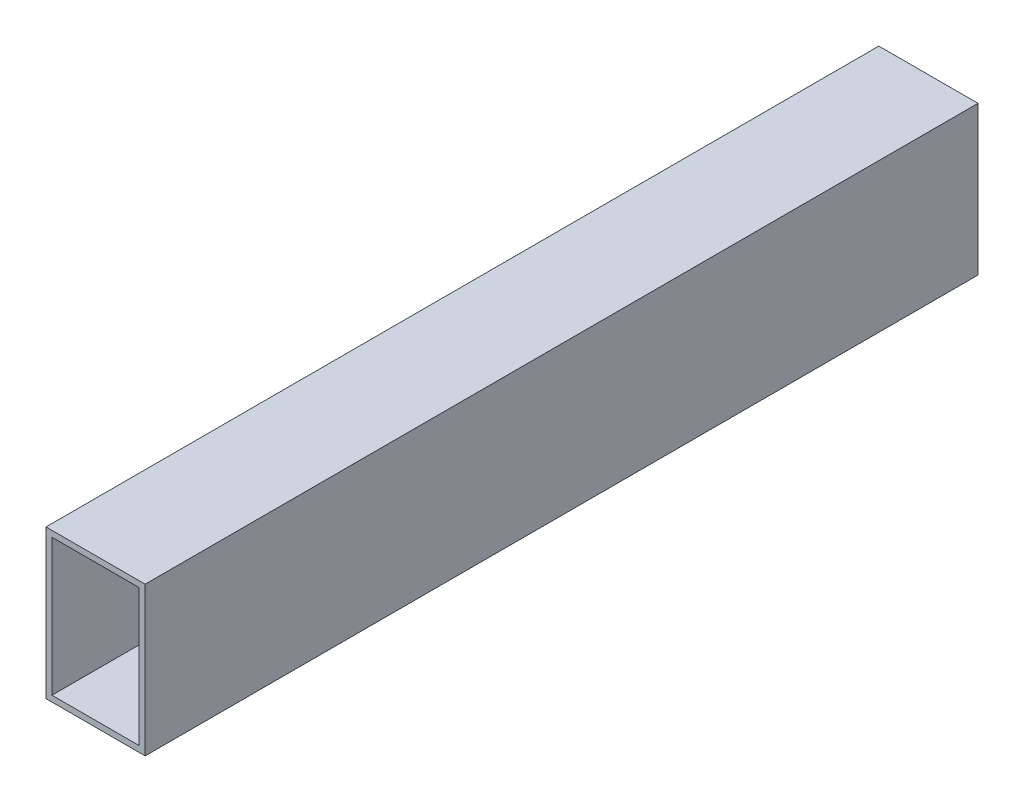
ISO-10303-21;
HEADER;
FILE_DESCRIPTION(('STEP AP214'),'2;1');
FILE_NAME('part.step','',(''),(''),'','','');
FILE_SCHEMA(('AUTOMOTIVE_DESIGN { 1 0 10303 214 1 1 1 1 }'));
ENDSEC;
DATA;
#1=APPLICATION_CONTEXT('core data for automotive mechanical design processes');
#2=APPLICATION_PROTOCOL_DEFINITION('international standard','automotive_design',2000,#1);
#3=PRODUCT_CONTEXT('',#1,'mechanical');
#4=PRODUCT('Part','Part','',(#3));
#5=PRODUCT_RELATED_PRODUCT_CATEGORY('part','',(#4));
#6=PRODUCT_DEFINITION_FORMATION('','',#4);
#7=PRODUCT_DEFINITION_CONTEXT('part definition',#1,'design');
#8=PRODUCT_DEFINITION('design','',#6,#7);
#9=PRODUCT_DEFINITION_SHAPE('','',#8);
#10=(LENGTH_UNIT() NAMED_UNIT(*) SI_UNIT(.MILLI.,.METRE.));
#11=(NAMED_UNIT(*) PLANE_ANGLE_UNIT() SI_UNIT($,.RADIAN.));
#12=(NAMED_UNIT(*) SI_UNIT($,.STERADIAN.) SOLID_ANGLE_UNIT());
#13=UNCERTAINTY_MEASURE_WITH_UNIT(LENGTH_MEASURE(1.E-05),#10,'distance_accuracy_value','');
#14=(GEOMETRIC_REPRESENTATION_CONTEXT(3) GLOBAL_UNCERTAINTY_ASSIGNED_CONTEXT((#13)) GLOBAL_UNIT_ASSIGNED_CONTEXT((#10,
#11,#12)) REPRESENTATION_CONTEXT('',''));
#15=CARTESIAN_POINT('',(0.,0.,0.));
#16=DIRECTION('',(0.,0.,1.));
#17=DIRECTION('',(1.,0.,0.));
#18=AXIS2_PLACEMENT_3D('',#15,#16,#17);
#19=CARTESIAN_POINT('',(0.,0.,420.));
#20=DIRECTION('',(0.,0.,-1.));
#21=DIRECTION('',(-1.,0.,0.));
#22=AXIS2_PLACEMENT_3D('',#19,#20,#21);
#23=PLANE('',#22);
#24=DIRECTION('',(0.,-1.,0.));
#25=VECTOR('',#24,1.);
#26=CARTESIAN_POINT('',(-50.,-75.,420.));
#27=LINE('',#26,#25);
#28=CARTESIAN_POINT('',(-50.,74.9999999999999,420.));
#29=VERTEX_POINT('',#28);
#30=CARTESIAN_POINT('',(-50.,-75.,420.));
#31=VERTEX_POINT('',#30);
#32=EDGE_CURVE('E139',#29,#31,#27,.T.);
#33=ORIENTED_EDGE('',*,*,#32,.T.);
#34=DIRECTION('',(1.,0.,0.));
#35=VECTOR('',#34,1.);
#36=CARTESIAN_POINT('',(-50.,-75.,420.));
#37=LINE('',#36,#35);
#38=CARTESIAN_POINT('',(50.,-75.,420.));
#39=VERTEX_POINT('',#38);
#40=EDGE_CURVE('E142',#31,#39,#37,.T.);
#41=ORIENTED_EDGE('',*,*,#40,.T.);
#42=DIRECTION('',(0.,1.,0.));
#43=VECTOR('',#42,1.);
#44=CARTESIAN_POINT('',(50.,-75.,420.));
#45=LINE('',#44,#43);
#46=CARTESIAN_POINT('',(50.,75.,420.));
#47=VERTEX_POINT('',#46);
#48=EDGE_CURVE('E147',#39,#47,#45,.T.);
#49=ORIENTED_EDGE('',*,*,#48,.T.);
#50=DIRECTION('',(-1.,0.,0.));
#51=VECTOR('',#50,1.);
#52=CARTESIAN_POINT('',(-50.,74.9999999999999,420.));
#53=LINE('',#52,#51);
#54=EDGE_CURVE('E149',#47,#29,#53,.T.);
#55=ORIENTED_EDGE('',*,*,#54,.T.);
#56=EDGE_LOOP('',(#33,#41,#49,#55));
#57=FACE_BOUND('',#56,.T.);
#58=DIRECTION('',(0.,-1.,0.));
#59=VECTOR('',#58,1.);
#60=CARTESIAN_POINT('',(-44.,-69.,420.));
#61=LINE('',#60,#59);
#62=CARTESIAN_POINT('',(-44.,69.,420.));
#63=VERTEX_POINT('',#62);
#64=CARTESIAN_POINT('',(-44.,-69.,420.));
#65=VERTEX_POINT('',#64);
#66=EDGE_CURVE('E101',#63,#65,#61,.T.);
#67=ORIENTED_EDGE('',*,*,#66,.F.);
#68=DIRECTION('',(-1.,0.,0.));
#69=VECTOR('',#68,1.);
#70=CARTESIAN_POINT('',(-44.,69.,420.));
#71=LINE('',#70,#69);
#72=CARTESIAN_POINT('',(44.,69.,420.));
#73=VERTEX_POINT('',#72);
#74=EDGE_CURVE('E128',#73,#63,#71,.T.);
#75=ORIENTED_EDGE('',*,*,#74,.F.);
#76=DIRECTION('',(0.,1.,0.));
#77=VECTOR('',#76,1.);
#78=CARTESIAN_POINT('',(44.,-69.,420.));
#79=LINE('',#78,#77);
#80=CARTESIAN_POINT('',(44.,-69.,420.));
#81=VERTEX_POINT('',#80);
#82=EDGE_CURVE('E125',#81,#73,#79,.T.);
#83=ORIENTED_EDGE('',*,*,#82,.F.);
#84=DIRECTION('',(1.,0.,0.));
#85=VECTOR('',#84,1.);
#86=CARTESIAN_POINT('',(-44.,-69.,420.));
#87=LINE('',#86,#85);
#88=EDGE_CURVE('E115',#65,#81,#87,.T.);
#89=ORIENTED_EDGE('',*,*,#88,.F.);
#90=EDGE_LOOP('',(#67,#75,#83,#89));
#91=FACE_BOUND('',#90,.T.);
#92=ADVANCED_FACE('F39',(#57,#91),#23,.F.);
#93=CARTESIAN_POINT('',(0.,0.,-420.));
#94=DIRECTION('',(0.,0.,-1.));
#95=DIRECTION('',(-1.,0.,0.));
#96=AXIS2_PLACEMENT_3D('',#93,#94,#95);
#97=PLANE('',#96);
#98=DIRECTION('',(0.,-1.,0.));
#99=VECTOR('',#98,1.);
#100=CARTESIAN_POINT('',(-50.,-75.,-420.));
#101=LINE('',#100,#99);
#102=CARTESIAN_POINT('',(-50.,74.9999999999999,-420.));
#103=VERTEX_POINT('',#102);
#104=CARTESIAN_POINT('',(-50.,-75.,-420.));
#105=VERTEX_POINT('',#104);
#106=EDGE_CURVE('E117',#103,#105,#101,.T.);
#107=ORIENTED_EDGE('',*,*,#106,.F.);
#108=DIRECTION('',(-1.,0.,0.));
#109=VECTOR('',#108,1.);
#110=CARTESIAN_POINT('',(-50.,74.9999999999999,-420.));
#111=LINE('',#110,#109);
#112=CARTESIAN_POINT('',(50.,75.,-420.));
#113=VERTEX_POINT('',#112);
#114=EDGE_CURVE('E143',#113,#103,#111,.T.);
#115=ORIENTED_EDGE('',*,*,#114,.F.);
#116=DIRECTION('',(0.,1.,0.));
#117=VECTOR('',#116,1.);
#118=CARTESIAN_POINT('',(50.,-75.,-420.));
#119=LINE('',#118,#117);
#120=CARTESIAN_POINT('',(50.,-75.,-420.));
#121=VERTEX_POINT('',#120);
#122=EDGE_CURVE('E153',#121,#113,#119,.T.);
#123=ORIENTED_EDGE('',*,*,#122,.F.);
#124=DIRECTION('',(1.,0.,0.));
#125=VECTOR('',#124,1.);
#126=CARTESIAN_POINT('',(-50.,-75.,-420.));
#127=LINE('',#126,#125);
#128=EDGE_CURVE('E155',#105,#121,#127,.T.);
#129=ORIENTED_EDGE('',*,*,#128,.F.);
#130=EDGE_LOOP('',(#107,#115,#123,#129));
#131=FACE_BOUND('',#130,.T.);
#132=DIRECTION('',(-1.,0.,0.));
#133=VECTOR('',#132,1.);
#134=CARTESIAN_POINT('',(-44.,69.,-420.));
#135=LINE('',#134,#133);
#136=CARTESIAN_POINT('',(44.,69.,-420.));
#137=VERTEX_POINT('',#136);
#138=CARTESIAN_POINT('',(-44.,69.,-420.));
#139=VERTEX_POINT('',#138);
#140=EDGE_CURVE('E111',#137,#139,#135,.T.);
#141=ORIENTED_EDGE('',*,*,#140,.T.);
#142=DIRECTION('',(0.,-1.,0.));
#143=VECTOR('',#142,1.);
#144=CARTESIAN_POINT('',(-44.,-69.,-420.));
#145=LINE('',#144,#143);
#146=CARTESIAN_POINT('',(-44.,-69.,-420.));
#147=VERTEX_POINT('',#146);
#148=EDGE_CURVE('E64',#139,#147,#145,.T.);
#149=ORIENTED_EDGE('',*,*,#148,.T.);
#150=DIRECTION('',(1.,0.,0.));
#151=VECTOR('',#150,1.);
#152=CARTESIAN_POINT('',(-44.,-69.,-420.));
#153=LINE('',#152,#151);
#154=CARTESIAN_POINT('',(44.,-69.,-420.));
#155=VERTEX_POINT('',#154);
#156=EDGE_CURVE('E119',#147,#155,#153,.T.);
#157=ORIENTED_EDGE('',*,*,#156,.T.);
#158=DIRECTION('',(0.,1.,0.));
#159=VECTOR('',#158,1.);
#160=CARTESIAN_POINT('',(44.,-69.,-420.));
#161=LINE('',#160,#159);
#162=EDGE_CURVE('E135',#155,#137,#161,.T.);
#163=ORIENTED_EDGE('',*,*,#162,.T.);
#164=EDGE_LOOP('',(#141,#149,#157,#163));
#165=FACE_BOUND('',#164,.T.);
#166=ADVANCED_FACE('F171',(#131,#165),#97,.T.);
#167=CARTESIAN_POINT('',(-50.,-75.,420.));
#168=DIRECTION('',(1.,0.,0.));
#169=DIRECTION('',(0.,1.,0.));
#170=AXIS2_PLACEMENT_3D('',#167,#168,#169);
#171=PLANE('',#170);
#172=ORIENTED_EDGE('',*,*,#106,.T.);
#173=DIRECTION('',(0.,0.,-1.));
#174=VECTOR('',#173,1.);
#175=CARTESIAN_POINT('',(-50.,-75.,420.));
#176=LINE('',#175,#174);
#177=EDGE_CURVE('E11',#31,#105,#176,.T.);
#178=ORIENTED_EDGE('',*,*,#177,.F.);
#179=ORIENTED_EDGE('',*,*,#32,.F.);
#180=DIRECTION('',(0.,0.,-1.));
#181=VECTOR('',#180,1.);
#182=CARTESIAN_POINT('',(-50.,74.9999999999999,420.));
#183=LINE('',#182,#181);
#184=EDGE_CURVE('E148',#29,#103,#183,.T.);
#185=ORIENTED_EDGE('',*,*,#184,.T.);
#186=EDGE_LOOP('',(#172,#178,#179,#185));
#187=FACE_BOUND('',#186,.T.);
#188=ADVANCED_FACE('F41',(#187),#171,.F.);
#189=CARTESIAN_POINT('',(-50.,-75.,420.));
#190=DIRECTION('',(0.,1.,0.));
#191=DIRECTION('',(0.,0.,1.));
#192=AXIS2_PLACEMENT_3D('',#189,#190,#191);
#193=PLANE('',#192);
#194=ORIENTED_EDGE('',*,*,#128,.T.);
#195=DIRECTION('',(0.,0.,-1.));
#196=VECTOR('',#195,1.);
#197=CARTESIAN_POINT('',(50.,-75.,420.));
#198=LINE('',#197,#196);
#199=EDGE_CURVE('E50',#39,#121,#198,.T.);
#200=ORIENTED_EDGE('',*,*,#199,.F.);
#201=ORIENTED_EDGE('',*,*,#40,.F.);
#202=ORIENTED_EDGE('',*,*,#177,.T.);
#203=EDGE_LOOP('',(#194,#200,#201,#202));
#204=FACE_BOUND('',#203,.T.);
#205=ADVANCED_FACE('F183',(#204),#193,.F.);
#206=CARTESIAN_POINT('',(50.,-75.,420.));
#207=DIRECTION('',(-1.,0.,0.));
#208=DIRECTION('',(0.,-1.,0.));
#209=AXIS2_PLACEMENT_3D('',#206,#207,#208);
#210=PLANE('',#209);
#211=ORIENTED_EDGE('',*,*,#122,.T.);
#212=DIRECTION('',(0.,0.,-1.));
#213=VECTOR('',#212,1.);
#214=CARTESIAN_POINT('',(50.,75.,420.));
#215=LINE('',#214,#213);
#216=EDGE_CURVE('E158',#47,#113,#215,.T.);
#217=ORIENTED_EDGE('',*,*,#216,.F.);
#218=ORIENTED_EDGE('',*,*,#48,.F.);
#219=ORIENTED_EDGE('',*,*,#199,.T.);
#220=EDGE_LOOP('',(#211,#217,#218,#219));
#221=FACE_BOUND('',#220,.T.);
#222=ADVANCED_FACE('F167',(#221),#210,.F.);
#223=CARTESIAN_POINT('',(-50.,74.9999999999999,420.));
#224=DIRECTION('',(0.,-1.,0.));
#225=DIRECTION('',(1.,0.,0.));
#226=AXIS2_PLACEMENT_3D('',#223,#224,#225);
#227=PLANE('',#226);
#228=ORIENTED_EDGE('',*,*,#114,.T.);
#229=ORIENTED_EDGE('',*,*,#184,.F.);
#230=ORIENTED_EDGE('',*,*,#54,.F.);
#231=ORIENTED_EDGE('',*,*,#216,.T.);
#232=EDGE_LOOP('',(#228,#229,#230,#231));
#233=FACE_BOUND('',#232,.T.);
#234=ADVANCED_FACE('F180',(#233),#227,.F.);
#235=CARTESIAN_POINT('',(-44.,-69.,420.));
#236=DIRECTION('',(1.,0.,0.));
#237=DIRECTION('',(0.,0.,-1.));
#238=AXIS2_PLACEMENT_3D('',#235,#236,#237);
#239=PLANE('',#238);
#240=ORIENTED_EDGE('',*,*,#148,.F.);
#241=DIRECTION('',(0.,0.,-1.));
#242=VECTOR('',#241,1.);
#243=CARTESIAN_POINT('',(-44.,69.,420.));
#244=LINE('',#243,#242);
#245=EDGE_CURVE('E110',#63,#139,#244,.T.);
#246=ORIENTED_EDGE('',*,*,#245,.F.);
#247=ORIENTED_EDGE('',*,*,#66,.T.);
#248=DIRECTION('',(0.,0.,-1.));
#249=VECTOR('',#248,1.);
#250=CARTESIAN_POINT('',(-44.,-69.,420.));
#251=LINE('',#250,#249);
#252=EDGE_CURVE('E109',#65,#147,#251,.T.);
#253=ORIENTED_EDGE('',*,*,#252,.T.);
#254=EDGE_LOOP('',(#240,#246,#247,#253));
#255=FACE_BOUND('',#254,.T.);
#256=ADVANCED_FACE('F107',(#255),#239,.T.);
#257=CARTESIAN_POINT('',(-44.,-69.,420.));
#258=DIRECTION('',(0.,1.,0.));
#259=DIRECTION('',(0.,0.,1.));
#260=AXIS2_PLACEMENT_3D('',#257,#258,#259);
#261=PLANE('',#260);
#262=ORIENTED_EDGE('',*,*,#156,.F.);
#263=ORIENTED_EDGE('',*,*,#252,.F.);
#264=ORIENTED_EDGE('',*,*,#88,.T.);
#265=DIRECTION('',(0.,0.,-1.));
#266=VECTOR('',#265,1.);
#267=CARTESIAN_POINT('',(44.,-69.,420.));
#268=LINE('',#267,#266);
#269=EDGE_CURVE('E123',#81,#155,#268,.T.);
#270=ORIENTED_EDGE('',*,*,#269,.T.);
#271=EDGE_LOOP('',(#262,#263,#264,#270));
#272=FACE_BOUND('',#271,.T.);
#273=ADVANCED_FACE('F118',(#272),#261,.T.);
#274=CARTESIAN_POINT('',(44.,-69.,420.));
#275=DIRECTION('',(-1.,0.,0.));
#276=DIRECTION('',(0.,0.,1.));
#277=AXIS2_PLACEMENT_3D('',#274,#275,#276);
#278=PLANE('',#277);
#279=ORIENTED_EDGE('',*,*,#162,.F.);
#280=ORIENTED_EDGE('',*,*,#269,.F.);
#281=ORIENTED_EDGE('',*,*,#82,.T.);
#282=DIRECTION('',(0.,0.,-1.));
#283=VECTOR('',#282,1.);
#284=CARTESIAN_POINT('',(44.,69.,420.));
#285=LINE('',#284,#283);
#286=EDGE_CURVE('E53',#73,#137,#285,.T.);
#287=ORIENTED_EDGE('',*,*,#286,.T.);
#288=EDGE_LOOP('',(#279,#280,#281,#287));
#289=FACE_BOUND('',#288,.T.);
#290=ADVANCED_FACE('F208',(#289),#278,.T.);
#291=CARTESIAN_POINT('',(-44.,69.,420.));
#292=DIRECTION('',(0.,-1.,0.));
#293=DIRECTION('',(0.,0.,-1.));
#294=AXIS2_PLACEMENT_3D('',#291,#292,#293);
#295=PLANE('',#294);
#296=ORIENTED_EDGE('',*,*,#140,.F.);
#297=ORIENTED_EDGE('',*,*,#286,.F.);
#298=ORIENTED_EDGE('',*,*,#74,.T.);
#299=ORIENTED_EDGE('',*,*,#245,.T.);
#300=EDGE_LOOP('',(#296,#297,#298,#299));
#301=FACE_BOUND('',#300,.T.);
#302=ADVANCED_FACE('F207',(#301),#295,.T.);
#303=CLOSED_SHELL('',(#92,#166,#188,#205,#222,#234,#256,#273,#290,#302));
#304=MANIFOLD_SOLID_BREP('B2',#303);
#305=ADVANCED_BREP_SHAPE_REPRESENTATION('',(#18,#304),#14);
#306=SHAPE_DEFINITION_REPRESENTATION(#9,#305);
ENDSEC;
END-ISO-10303-21;
